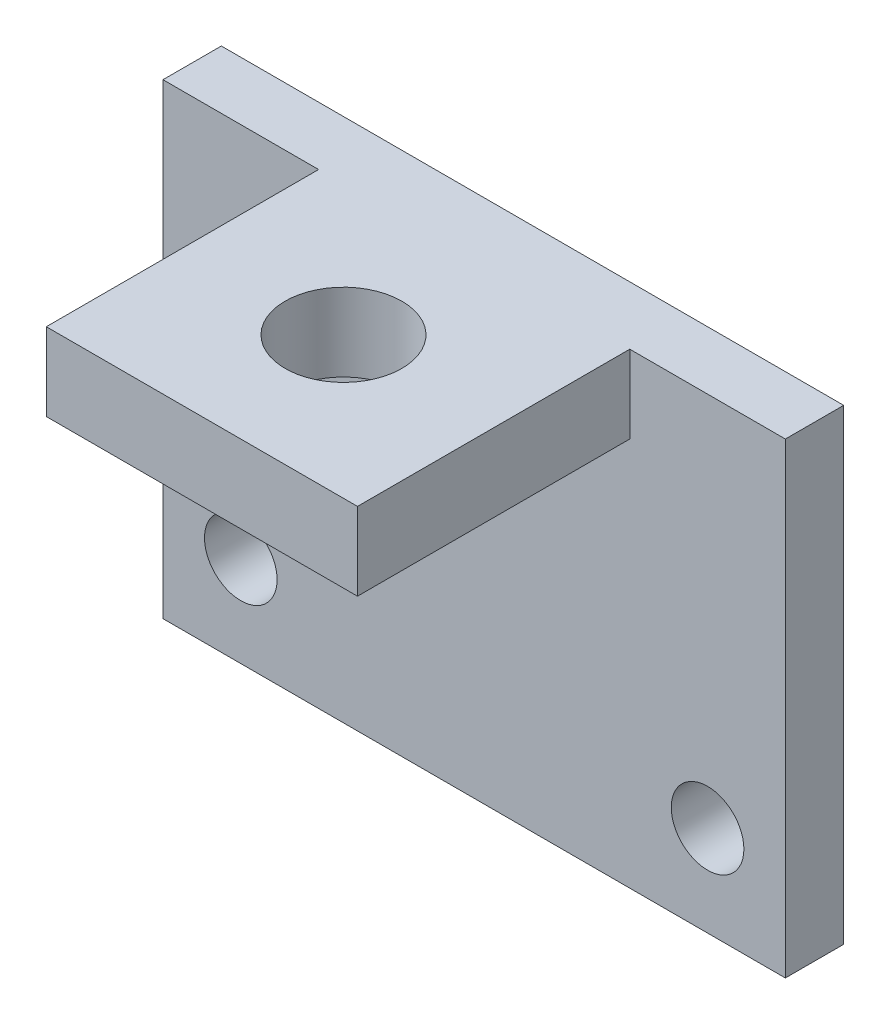
ISO-10303-21;
HEADER;
FILE_DESCRIPTION(('STEP AP214'),'2;1');
FILE_NAME('part.step','',(''),(''),'','','');
FILE_SCHEMA(('AUTOMOTIVE_DESIGN { 1 0 10303 214 1 1 1 1 }'));
ENDSEC;
DATA;
#1=APPLICATION_CONTEXT('core data for automotive mechanical design processes');
#2=APPLICATION_PROTOCOL_DEFINITION('international standard','automotive_design',2000,#1);
#3=PRODUCT_CONTEXT('',#1,'mechanical');
#4=PRODUCT('Part','Part','',(#3));
#5=PRODUCT_RELATED_PRODUCT_CATEGORY('part','',(#4));
#6=PRODUCT_DEFINITION_FORMATION('','',#4);
#7=PRODUCT_DEFINITION_CONTEXT('part definition',#1,'design');
#8=PRODUCT_DEFINITION('design','',#6,#7);
#9=PRODUCT_DEFINITION_SHAPE('','',#8);
#10=(LENGTH_UNIT() NAMED_UNIT(*) SI_UNIT(.MILLI.,.METRE.));
#11=(NAMED_UNIT(*) PLANE_ANGLE_UNIT() SI_UNIT($,.RADIAN.));
#12=(NAMED_UNIT(*) SI_UNIT($,.STERADIAN.) SOLID_ANGLE_UNIT());
#13=UNCERTAINTY_MEASURE_WITH_UNIT(LENGTH_MEASURE(1.E-05),#10,'distance_accuracy_value','');
#14=(GEOMETRIC_REPRESENTATION_CONTEXT(3) GLOBAL_UNCERTAINTY_ASSIGNED_CONTEXT((#13)) GLOBAL_UNIT_ASSIGNED_CONTEXT((#10,
#11,#12)) REPRESENTATION_CONTEXT('',''));
#15=CARTESIAN_POINT('',(0.,0.,0.));
#16=DIRECTION('',(0.,0.,1.));
#17=DIRECTION('',(1.,0.,0.));
#18=AXIS2_PLACEMENT_3D('',#15,#16,#17);
#19=CARTESIAN_POINT('',(0.,0.,1.5));
#20=DIRECTION('',(0.,0.,-1.));
#21=DIRECTION('',(-1.,0.,0.));
#22=AXIS2_PLACEMENT_3D('',#19,#20,#21);
#23=PLANE('',#22);
#24=CARTESIAN_POINT('',(14.,2.33405736277209,1.5));
#25=DIRECTION('',(0.,0.,1.));
#26=DIRECTION('',(1.,0.,0.));
#27=AXIS2_PLACEMENT_3D('',#24,#25,#26);
#28=CIRCLE('',#27,0.933622945108836);
#29=CARTESIAN_POINT('',(14.9336229451088,2.33405736277209,1.5));
#30=VERTEX_POINT('',#29);
#31=EDGE_CURVE('E133',#30,#30,#28,.T.);
#32=ORIENTED_EDGE('',*,*,#31,.F.);
#33=EDGE_LOOP('',(#32));
#34=FACE_BOUND('',#33,.T.);
#35=CARTESIAN_POINT('',(2.,2.33405736277209,1.5));
#36=DIRECTION('',(0.,0.,1.));
#37=DIRECTION('',(1.,0.,0.));
#38=AXIS2_PLACEMENT_3D('',#35,#36,#37);
#39=CIRCLE('',#38,0.933622945108834);
#40=CARTESIAN_POINT('',(2.93362294510883,2.33405736277209,1.5));
#41=VERTEX_POINT('',#40);
#42=EDGE_CURVE('E143',#41,#41,#39,.T.);
#43=ORIENTED_EDGE('',*,*,#42,.F.);
#44=EDGE_LOOP('',(#43));
#45=FACE_BOUND('',#44,.T.);
#46=DIRECTION('',(0.,-1.,0.));
#47=VECTOR('',#46,1.);
#48=CARTESIAN_POINT('',(4.,12.,1.5));
#49=LINE('',#48,#47);
#50=CARTESIAN_POINT('',(4.,12.,1.5));
#51=VERTEX_POINT('',#50);
#52=CARTESIAN_POINT('',(4.,10.,1.5));
#53=VERTEX_POINT('',#52);
#54=EDGE_CURVE('E60',#51,#53,#49,.T.);
#55=ORIENTED_EDGE('',*,*,#54,.F.);
#56=DIRECTION('',(-1.,0.,0.));
#57=VECTOR('',#56,1.);
#58=CARTESIAN_POINT('',(0.,12.,1.5));
#59=LINE('',#58,#57);
#60=CARTESIAN_POINT('',(0.,12.,1.5));
#61=VERTEX_POINT('',#60);
#62=EDGE_CURVE('E162',#51,#61,#59,.T.);
#63=ORIENTED_EDGE('',*,*,#62,.T.);
#64=DIRECTION('',(0.,-1.,0.));
#65=VECTOR('',#64,1.);
#66=CARTESIAN_POINT('',(0.,0.,1.5));
#67=LINE('',#66,#65);
#68=CARTESIAN_POINT('',(0.,0.,1.5));
#69=VERTEX_POINT('',#68);
#70=EDGE_CURVE('E151',#61,#69,#67,.T.);
#71=ORIENTED_EDGE('',*,*,#70,.T.);
#72=DIRECTION('',(1.,0.,0.));
#73=VECTOR('',#72,1.);
#74=CARTESIAN_POINT('',(0.,0.,1.5));
#75=LINE('',#74,#73);
#76=CARTESIAN_POINT('',(16.,0.,1.5));
#77=VERTEX_POINT('',#76);
#78=EDGE_CURVE('E155',#69,#77,#75,.T.);
#79=ORIENTED_EDGE('',*,*,#78,.T.);
#80=DIRECTION('',(0.,1.,0.));
#81=VECTOR('',#80,1.);
#82=CARTESIAN_POINT('',(16.,0.,1.5));
#83=LINE('',#82,#81);
#84=CARTESIAN_POINT('',(16.,12.,1.5));
#85=VERTEX_POINT('',#84);
#86=EDGE_CURVE('E159',#77,#85,#83,.T.);
#87=ORIENTED_EDGE('',*,*,#86,.T.);
#88=CARTESIAN_POINT('',(12.,12.,1.5));
#89=VERTEX_POINT('',#88);
#90=EDGE_CURVE('E163',#85,#89,#59,.T.);
#91=ORIENTED_EDGE('',*,*,#90,.T.);
#92=DIRECTION('',(0.,1.,0.));
#93=VECTOR('',#92,1.);
#94=CARTESIAN_POINT('',(12.,12.,1.5));
#95=LINE('',#94,#93);
#96=CARTESIAN_POINT('',(12.,10.,1.5));
#97=VERTEX_POINT('',#96);
#98=EDGE_CURVE('E124',#97,#89,#95,.T.);
#99=ORIENTED_EDGE('',*,*,#98,.F.);
#100=DIRECTION('',(1.,0.,0.));
#101=VECTOR('',#100,1.);
#102=CARTESIAN_POINT('',(4.,10.,1.5));
#103=LINE('',#102,#101);
#104=EDGE_CURVE('E55',#53,#97,#103,.T.);
#105=ORIENTED_EDGE('',*,*,#104,.F.);
#106=EDGE_LOOP('',(#55,#63,#71,#79,#87,#91,#99,#105));
#107=FACE_BOUND('',#106,.T.);
#108=ADVANCED_FACE('F39',(#34,#45,#107),#23,.F.);
#109=CARTESIAN_POINT('',(0.,0.,0.));
#110=DIRECTION('',(0.,0.,-1.));
#111=DIRECTION('',(-1.,0.,0.));
#112=AXIS2_PLACEMENT_3D('',#109,#110,#111);
#113=PLANE('',#112);
#114=CARTESIAN_POINT('',(2.,2.33405736277209,0.));
#115=DIRECTION('',(0.,0.,1.));
#116=DIRECTION('',(1.,0.,0.));
#117=AXIS2_PLACEMENT_3D('',#114,#115,#116);
#118=CIRCLE('',#117,0.933622945108834);
#119=CARTESIAN_POINT('',(2.93362294510883,2.33405736277209,0.));
#120=VERTEX_POINT('',#119);
#121=EDGE_CURVE('E141',#120,#120,#118,.T.);
#122=ORIENTED_EDGE('',*,*,#121,.T.);
#123=EDGE_LOOP('',(#122));
#124=FACE_BOUND('',#123,.T.);
#125=DIRECTION('',(0.,-1.,0.));
#126=VECTOR('',#125,1.);
#127=CARTESIAN_POINT('',(0.,0.,0.));
#128=LINE('',#127,#126);
#129=CARTESIAN_POINT('',(0.,12.,0.));
#130=VERTEX_POINT('',#129);
#131=CARTESIAN_POINT('',(0.,0.,0.));
#132=VERTEX_POINT('',#131);
#133=EDGE_CURVE('E147',#130,#132,#128,.T.);
#134=ORIENTED_EDGE('',*,*,#133,.F.);
#135=DIRECTION('',(-1.,0.,0.));
#136=VECTOR('',#135,1.);
#137=CARTESIAN_POINT('',(0.,12.,0.));
#138=LINE('',#137,#136);
#139=CARTESIAN_POINT('',(16.,12.,0.));
#140=VERTEX_POINT('',#139);
#141=EDGE_CURVE('E156',#140,#130,#138,.T.);
#142=ORIENTED_EDGE('',*,*,#141,.F.);
#143=DIRECTION('',(0.,1.,0.));
#144=VECTOR('',#143,1.);
#145=CARTESIAN_POINT('',(16.,0.,0.));
#146=LINE('',#145,#144);
#147=CARTESIAN_POINT('',(16.,0.,0.));
#148=VERTEX_POINT('',#147);
#149=EDGE_CURVE('E173',#148,#140,#146,.T.);
#150=ORIENTED_EDGE('',*,*,#149,.F.);
#151=DIRECTION('',(1.,0.,0.));
#152=VECTOR('',#151,1.);
#153=CARTESIAN_POINT('',(0.,0.,0.));
#154=LINE('',#153,#152);
#155=EDGE_CURVE('E170',#132,#148,#154,.T.);
#156=ORIENTED_EDGE('',*,*,#155,.F.);
#157=EDGE_LOOP('',(#134,#142,#150,#156));
#158=FACE_BOUND('',#157,.T.);
#159=CARTESIAN_POINT('',(14.,2.33405736277209,0.));
#160=DIRECTION('',(0.,0.,1.));
#161=DIRECTION('',(1.,0.,0.));
#162=AXIS2_PLACEMENT_3D('',#159,#160,#161);
#163=CIRCLE('',#162,0.933622945108836);
#164=CARTESIAN_POINT('',(14.9336229451088,2.33405736277209,0.));
#165=VERTEX_POINT('',#164);
#166=EDGE_CURVE('E128',#165,#165,#163,.T.);
#167=ORIENTED_EDGE('',*,*,#166,.T.);
#168=EDGE_LOOP('',(#167));
#169=FACE_BOUND('',#168,.T.);
#170=ADVANCED_FACE('F196',(#124,#158,#169),#113,.T.);
#171=CARTESIAN_POINT('',(0.,0.,1.5));
#172=DIRECTION('',(1.,0.,0.));
#173=DIRECTION('',(0.,0.,-1.));
#174=AXIS2_PLACEMENT_3D('',#171,#172,#173);
#175=PLANE('',#174);
#176=ORIENTED_EDGE('',*,*,#133,.T.);
#177=DIRECTION('',(0.,0.,-1.));
#178=VECTOR('',#177,1.);
#179=CARTESIAN_POINT('',(0.,0.,1.5));
#180=LINE('',#179,#178);
#181=EDGE_CURVE('E11',#69,#132,#180,.T.);
#182=ORIENTED_EDGE('',*,*,#181,.F.);
#183=ORIENTED_EDGE('',*,*,#70,.F.);
#184=DIRECTION('',(0.,0.,-1.));
#185=VECTOR('',#184,1.);
#186=CARTESIAN_POINT('',(0.,12.,1.5));
#187=LINE('',#186,#185);
#188=EDGE_CURVE('E166',#61,#130,#187,.T.);
#189=ORIENTED_EDGE('',*,*,#188,.T.);
#190=EDGE_LOOP('',(#176,#182,#183,#189));
#191=FACE_BOUND('',#190,.T.);
#192=ADVANCED_FACE('F41',(#191),#175,.F.);
#193=CARTESIAN_POINT('',(0.,0.,1.5));
#194=DIRECTION('',(0.,1.,0.));
#195=DIRECTION('',(0.,0.,1.));
#196=AXIS2_PLACEMENT_3D('',#193,#194,#195);
#197=PLANE('',#196);
#198=ORIENTED_EDGE('',*,*,#155,.T.);
#199=DIRECTION('',(0.,0.,-1.));
#200=VECTOR('',#199,1.);
#201=CARTESIAN_POINT('',(16.,0.,1.5));
#202=LINE('',#201,#200);
#203=EDGE_CURVE('E48',#77,#148,#202,.T.);
#204=ORIENTED_EDGE('',*,*,#203,.F.);
#205=ORIENTED_EDGE('',*,*,#78,.F.);
#206=ORIENTED_EDGE('',*,*,#181,.T.);
#207=EDGE_LOOP('',(#198,#204,#205,#206));
#208=FACE_BOUND('',#207,.T.);
#209=ADVANCED_FACE('F264',(#208),#197,.F.);
#210=CARTESIAN_POINT('',(16.,0.,1.5));
#211=DIRECTION('',(-1.,0.,0.));
#212=DIRECTION('',(0.,0.,1.));
#213=AXIS2_PLACEMENT_3D('',#210,#211,#212);
#214=PLANE('',#213);
#215=ORIENTED_EDGE('',*,*,#149,.T.);
#216=DIRECTION('',(0.,0.,-1.));
#217=VECTOR('',#216,1.);
#218=CARTESIAN_POINT('',(16.,12.,1.5));
#219=LINE('',#218,#217);
#220=EDGE_CURVE('E181',#85,#140,#219,.T.);
#221=ORIENTED_EDGE('',*,*,#220,.F.);
#222=ORIENTED_EDGE('',*,*,#86,.F.);
#223=ORIENTED_EDGE('',*,*,#203,.T.);
#224=EDGE_LOOP('',(#215,#221,#222,#223));
#225=FACE_BOUND('',#224,.T.);
#226=ADVANCED_FACE('F190',(#225),#214,.F.);
#227=CARTESIAN_POINT('',(0.,12.,1.5));
#228=DIRECTION('',(0.,-1.,0.));
#229=DIRECTION('',(0.,0.,-1.));
#230=AXIS2_PLACEMENT_3D('',#227,#228,#229);
#231=PLANE('',#230);
#232=CARTESIAN_POINT('',(8.,12.,4.86));
#233=DIRECTION('',(0.,-1.,0.));
#234=DIRECTION('',(0.,0.,-1.));
#235=AXIS2_PLACEMENT_3D('',#232,#233,#234);
#236=CIRCLE('',#235,1.5);
#237=CARTESIAN_POINT('',(8.,12.,3.36));
#238=VERTEX_POINT('',#237);
#239=EDGE_CURVE('E220',#238,#238,#236,.T.);
#240=ORIENTED_EDGE('',*,*,#239,.T.);
#241=EDGE_LOOP('',(#240));
#242=FACE_BOUND('',#241,.T.);
#243=ORIENTED_EDGE('',*,*,#141,.T.);
#244=ORIENTED_EDGE('',*,*,#188,.F.);
#245=ORIENTED_EDGE('',*,*,#62,.F.);
#246=DIRECTION('',(0.,0.,-1.));
#247=VECTOR('',#246,1.);
#248=CARTESIAN_POINT('',(4.,12.,8.5));
#249=LINE('',#248,#247);
#250=CARTESIAN_POINT('',(4.,12.,8.5));
#251=VERTEX_POINT('',#250);
#252=EDGE_CURVE('E206',#251,#51,#249,.T.);
#253=ORIENTED_EDGE('',*,*,#252,.F.);
#254=DIRECTION('',(-1.,0.,0.));
#255=VECTOR('',#254,1.);
#256=CARTESIAN_POINT('',(4.,12.,8.5));
#257=LINE('',#256,#255);
#258=CARTESIAN_POINT('',(12.,12.,8.5));
#259=VERTEX_POINT('',#258);
#260=EDGE_CURVE('E119',#259,#251,#257,.T.);
#261=ORIENTED_EDGE('',*,*,#260,.F.);
#262=DIRECTION('',(0.,0.,-1.));
#263=VECTOR('',#262,1.);
#264=CARTESIAN_POINT('',(12.,12.,8.5));
#265=LINE('',#264,#263);
#266=EDGE_CURVE('E135',#259,#89,#265,.T.);
#267=ORIENTED_EDGE('',*,*,#266,.T.);
#268=ORIENTED_EDGE('',*,*,#90,.F.);
#269=ORIENTED_EDGE('',*,*,#220,.T.);
#270=EDGE_LOOP('',(#243,#244,#245,#253,#261,#267,#268,#269));
#271=FACE_BOUND('',#270,.T.);
#272=ADVANCED_FACE('F200',(#242,#271),#231,.F.);
#273=CARTESIAN_POINT('',(2.,2.33405736277209,1.5));
#274=DIRECTION('',(0.,0.,-1.));
#275=DIRECTION('',(-1.,0.,0.));
#276=AXIS2_PLACEMENT_3D('',#273,#274,#275);
#277=CYLINDRICAL_SURFACE('',#276,0.933622945108834);
#278=ORIENTED_EDGE('',*,*,#42,.T.);
#279=EDGE_LOOP('',(#278));
#280=FACE_BOUND('',#279,.T.);
#281=ORIENTED_EDGE('',*,*,#121,.F.);
#282=EDGE_LOOP('',(#281));
#283=FACE_BOUND('',#282,.T.);
#284=ADVANCED_FACE('F257',(#280,#283),#277,.F.);
#285=CARTESIAN_POINT('',(14.,2.33405736277209,1.5));
#286=DIRECTION('',(0.,0.,-1.));
#287=DIRECTION('',(-1.,0.,0.));
#288=AXIS2_PLACEMENT_3D('',#285,#286,#287);
#289=CYLINDRICAL_SURFACE('',#288,0.933622945108836);
#290=ORIENTED_EDGE('',*,*,#31,.T.);
#291=EDGE_LOOP('',(#290));
#292=FACE_BOUND('',#291,.T.);
#293=ORIENTED_EDGE('',*,*,#166,.F.);
#294=EDGE_LOOP('',(#293));
#295=FACE_BOUND('',#294,.T.);
#296=ADVANCED_FACE('F244',(#292,#295),#289,.F.);
#297=CARTESIAN_POINT('',(4.,12.,8.5));
#298=DIRECTION('',(1.,0.,0.));
#299=DIRECTION('',(0.,0.,-1.));
#300=AXIS2_PLACEMENT_3D('',#297,#298,#299);
#301=PLANE('',#300);
#302=ORIENTED_EDGE('',*,*,#54,.T.);
#303=DIRECTION('',(0.,0.,-1.));
#304=VECTOR('',#303,1.);
#305=CARTESIAN_POINT('',(4.,10.,8.5));
#306=LINE('',#305,#304);
#307=CARTESIAN_POINT('',(4.,10.,8.5));
#308=VERTEX_POINT('',#307);
#309=EDGE_CURVE('E107',#308,#53,#306,.T.);
#310=ORIENTED_EDGE('',*,*,#309,.F.);
#311=DIRECTION('',(0.,-1.,0.));
#312=VECTOR('',#311,1.);
#313=CARTESIAN_POINT('',(4.,12.,8.5));
#314=LINE('',#313,#312);
#315=EDGE_CURVE('E114',#251,#308,#314,.T.);
#316=ORIENTED_EDGE('',*,*,#315,.F.);
#317=ORIENTED_EDGE('',*,*,#252,.T.);
#318=EDGE_LOOP('',(#302,#310,#316,#317));
#319=FACE_BOUND('',#318,.T.);
#320=ADVANCED_FACE('F126',(#319),#301,.F.);
#321=CARTESIAN_POINT('',(4.,10.,8.5));
#322=DIRECTION('',(0.,1.,0.));
#323=DIRECTION('',(0.,0.,1.));
#324=AXIS2_PLACEMENT_3D('',#321,#322,#323);
#325=PLANE('',#324);
#326=CARTESIAN_POINT('',(8.,10.,4.86));
#327=DIRECTION('',(0.,-1.,0.));
#328=DIRECTION('',(0.,0.,-1.));
#329=AXIS2_PLACEMENT_3D('',#326,#327,#328);
#330=CIRCLE('',#329,1.5);
#331=CARTESIAN_POINT('',(8.,10.,3.36));
#332=VERTEX_POINT('',#331);
#333=EDGE_CURVE('E227',#332,#332,#330,.T.);
#334=ORIENTED_EDGE('',*,*,#333,.F.);
#335=EDGE_LOOP('',(#334));
#336=FACE_BOUND('',#335,.T.);
#337=ORIENTED_EDGE('',*,*,#104,.T.);
#338=DIRECTION('',(0.,0.,-1.));
#339=VECTOR('',#338,1.);
#340=CARTESIAN_POINT('',(12.,10.,8.5));
#341=LINE('',#340,#339);
#342=CARTESIAN_POINT('',(12.,10.,8.5));
#343=VERTEX_POINT('',#342);
#344=EDGE_CURVE('E109',#343,#97,#341,.T.);
#345=ORIENTED_EDGE('',*,*,#344,.F.);
#346=DIRECTION('',(1.,0.,0.));
#347=VECTOR('',#346,1.);
#348=CARTESIAN_POINT('',(4.,10.,8.5));
#349=LINE('',#348,#347);
#350=EDGE_CURVE('E103',#308,#343,#349,.T.);
#351=ORIENTED_EDGE('',*,*,#350,.F.);
#352=ORIENTED_EDGE('',*,*,#309,.T.);
#353=EDGE_LOOP('',(#337,#345,#351,#352));
#354=FACE_BOUND('',#353,.T.);
#355=ADVANCED_FACE('F105',(#336,#354),#325,.F.);
#356=CARTESIAN_POINT('',(12.,12.,8.5));
#357=DIRECTION('',(-1.,0.,0.));
#358=DIRECTION('',(0.,0.,1.));
#359=AXIS2_PLACEMENT_3D('',#356,#357,#358);
#360=PLANE('',#359);
#361=ORIENTED_EDGE('',*,*,#98,.T.);
#362=ORIENTED_EDGE('',*,*,#266,.F.);
#363=DIRECTION('',(0.,1.,0.));
#364=VECTOR('',#363,1.);
#365=CARTESIAN_POINT('',(12.,12.,8.5));
#366=LINE('',#365,#364);
#367=EDGE_CURVE('E113',#343,#259,#366,.T.);
#368=ORIENTED_EDGE('',*,*,#367,.F.);
#369=ORIENTED_EDGE('',*,*,#344,.T.);
#370=EDGE_LOOP('',(#361,#362,#368,#369));
#371=FACE_BOUND('',#370,.T.);
#372=ADVANCED_FACE('F236',(#371),#360,.F.);
#373=CARTESIAN_POINT('',(0.,0.,8.5));
#374=DIRECTION('',(0.,0.,1.));
#375=DIRECTION('',(1.,0.,0.));
#376=AXIS2_PLACEMENT_3D('',#373,#374,#375);
#377=PLANE('',#376);
#378=ORIENTED_EDGE('',*,*,#315,.T.);
#379=ORIENTED_EDGE('',*,*,#350,.T.);
#380=ORIENTED_EDGE('',*,*,#367,.T.);
#381=ORIENTED_EDGE('',*,*,#260,.T.);
#382=EDGE_LOOP('',(#378,#379,#380,#381));
#383=FACE_BOUND('',#382,.T.);
#384=ADVANCED_FACE('F117',(#383),#377,.T.);
#385=CARTESIAN_POINT('',(8.,13.,4.86));
#386=DIRECTION('',(0.,-1.,0.));
#387=DIRECTION('',(0.,0.,-1.));
#388=AXIS2_PLACEMENT_3D('',#385,#386,#387);
#389=CYLINDRICAL_SURFACE('',#388,1.5);
#390=ORIENTED_EDGE('',*,*,#333,.T.);
#391=EDGE_LOOP('',(#390));
#392=FACE_BOUND('',#391,.T.);
#393=ORIENTED_EDGE('',*,*,#239,.F.);
#394=EDGE_LOOP('',(#393));
#395=FACE_BOUND('',#394,.T.);
#396=ADVANCED_FACE('F232',(#392,#395),#389,.F.);
#397=CLOSED_SHELL('',(#108,#170,#192,#209,#226,#272,#284,#296,#320,#355,#372,#384,#396));
#398=MANIFOLD_SOLID_BREP('B2',#397);
#399=ADVANCED_BREP_SHAPE_REPRESENTATION('',(#18,#398),#14);
#400=SHAPE_DEFINITION_REPRESENTATION(#9,#399);
ENDSEC;
END-ISO-10303-21;
